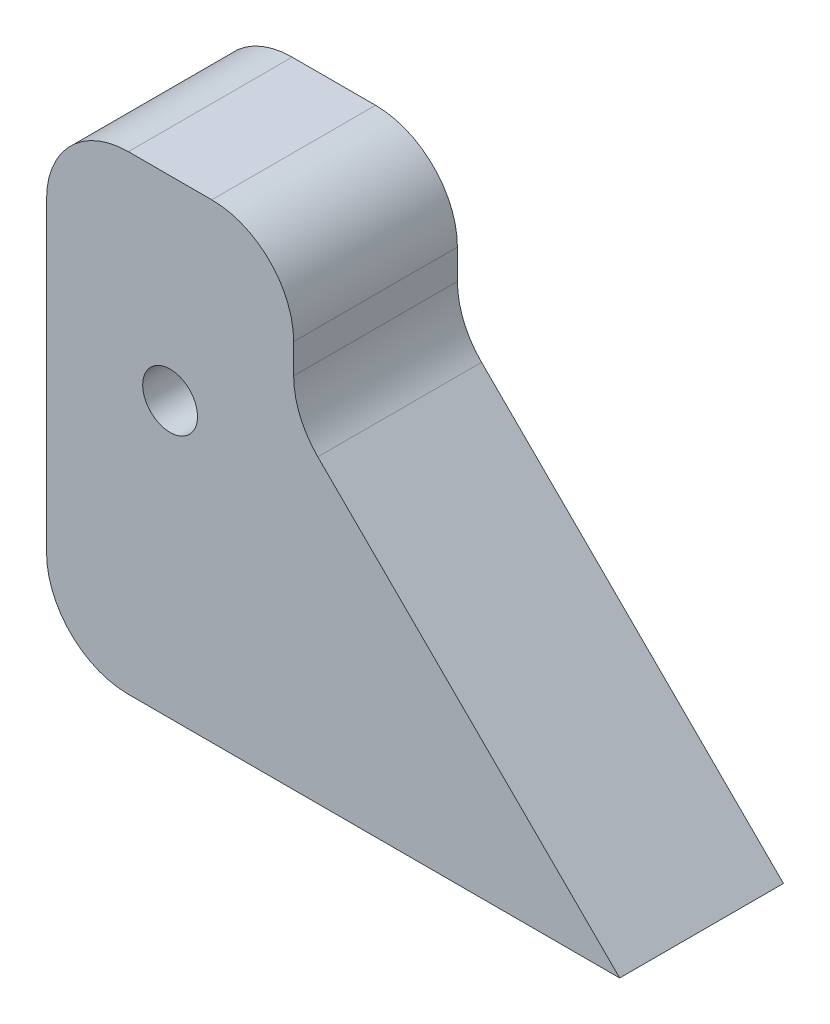
ISO-10303-21;
HEADER;
FILE_DESCRIPTION(('STEP AP214'),'2;1');
FILE_NAME('part.step','',(''),(''),'','','');
FILE_SCHEMA(('AUTOMOTIVE_DESIGN { 1 0 10303 214 1 1 1 1 }'));
ENDSEC;
DATA;
#1=APPLICATION_CONTEXT('core data for automotive mechanical design processes');
#2=APPLICATION_PROTOCOL_DEFINITION('international standard','automotive_design',2000,#1);
#3=PRODUCT_CONTEXT('',#1,'mechanical');
#4=PRODUCT('Part','Part','',(#3));
#5=PRODUCT_RELATED_PRODUCT_CATEGORY('part','',(#4));
#6=PRODUCT_DEFINITION_FORMATION('','',#4);
#7=PRODUCT_DEFINITION_CONTEXT('part definition',#1,'design');
#8=PRODUCT_DEFINITION('design','',#6,#7);
#9=PRODUCT_DEFINITION_SHAPE('','',#8);
#10=(LENGTH_UNIT() NAMED_UNIT(*) SI_UNIT(.MILLI.,.METRE.));
#11=(NAMED_UNIT(*) PLANE_ANGLE_UNIT() SI_UNIT($,.RADIAN.));
#12=(NAMED_UNIT(*) SI_UNIT($,.STERADIAN.) SOLID_ANGLE_UNIT());
#13=UNCERTAINTY_MEASURE_WITH_UNIT(LENGTH_MEASURE(1.E-05),#10,'distance_accuracy_value','');
#14=(GEOMETRIC_REPRESENTATION_CONTEXT(3) GLOBAL_UNCERTAINTY_ASSIGNED_CONTEXT((#13)) GLOBAL_UNIT_ASSIGNED_CONTEXT((#10,
#11,#12)) REPRESENTATION_CONTEXT('',''));
#15=CARTESIAN_POINT('',(0.,0.,0.));
#16=DIRECTION('',(0.,0.,1.));
#17=DIRECTION('',(1.,0.,0.));
#18=AXIS2_PLACEMENT_3D('',#15,#16,#17);
#19=CARTESIAN_POINT('',(0.,0.,10.));
#20=DIRECTION('',(1.,0.,0.));
#21=DIRECTION('',(0.,0.,-1.));
#22=AXIS2_PLACEMENT_3D('',#19,#20,#21);
#23=PLANE('',#22);
#24=DIRECTION('',(0.,-1.,0.));
#25=VECTOR('',#24,1.);
#26=CARTESIAN_POINT('',(0.,0.,0.));
#27=LINE('',#26,#25);
#28=CARTESIAN_POINT('',(0.,23.7,0.));
#29=VERTEX_POINT('',#28);
#30=CARTESIAN_POINT('',(0.,5.,0.));
#31=VERTEX_POINT('',#30);
#32=EDGE_CURVE('E149',#29,#31,#27,.T.);
#33=ORIENTED_EDGE('',*,*,#32,.T.);
#34=DIRECTION('',(0.,0.,-1.));
#35=VECTOR('',#34,1.);
#36=CARTESIAN_POINT('',(0.,5.,10.));
#37=LINE('',#36,#35);
#38=CARTESIAN_POINT('',(0.,5.,10.));
#39=VERTEX_POINT('',#38);
#40=EDGE_CURVE('E171',#31,#39,#37,.F.);
#41=ORIENTED_EDGE('',*,*,#40,.T.);
#42=DIRECTION('',(0.,-1.,0.));
#43=VECTOR('',#42,1.);
#44=CARTESIAN_POINT('',(0.,0.,10.));
#45=LINE('',#44,#43);
#46=CARTESIAN_POINT('',(0.,23.7,10.));
#47=VERTEX_POINT('',#46);
#48=EDGE_CURVE('E127',#47,#39,#45,.T.);
#49=ORIENTED_EDGE('',*,*,#48,.F.);
#50=DIRECTION('',(0.,0.,-1.));
#51=VECTOR('',#50,1.);
#52=CARTESIAN_POINT('',(0.,23.7,10.));
#53=LINE('',#52,#51);
#54=EDGE_CURVE('E168',#47,#29,#53,.T.);
#55=ORIENTED_EDGE('',*,*,#54,.T.);
#56=EDGE_LOOP('',(#33,#41,#49,#55));
#57=FACE_BOUND('',#56,.T.);
#58=ADVANCED_FACE('F43',(#57),#23,.F.);
#59=CARTESIAN_POINT('',(0.,0.,10.));
#60=DIRECTION('',(0.,1.,0.));
#61=DIRECTION('',(0.,0.,1.));
#62=AXIS2_PLACEMENT_3D('',#59,#60,#61);
#63=PLANE('',#62);
#64=DIRECTION('',(1.,0.,0.));
#65=VECTOR('',#64,1.);
#66=CARTESIAN_POINT('',(0.,0.,10.));
#67=LINE('',#66,#65);
#68=CARTESIAN_POINT('',(5.,0.,10.));
#69=VERTEX_POINT('',#68);
#70=CARTESIAN_POINT('',(35.,0.,10.));
#71=VERTEX_POINT('',#70);
#72=EDGE_CURVE('E115',#69,#71,#67,.T.);
#73=ORIENTED_EDGE('',*,*,#72,.F.);
#74=DIRECTION('',(0.,0.,-1.));
#75=VECTOR('',#74,1.);
#76=CARTESIAN_POINT('',(5.,0.,10.));
#77=LINE('',#76,#75);
#78=CARTESIAN_POINT('',(5.,0.,0.));
#79=VERTEX_POINT('',#78);
#80=EDGE_CURVE('E137',#69,#79,#77,.T.);
#81=ORIENTED_EDGE('',*,*,#80,.T.);
#82=DIRECTION('',(1.,0.,0.));
#83=VECTOR('',#82,1.);
#84=CARTESIAN_POINT('',(0.,0.,0.));
#85=LINE('',#84,#83);
#86=CARTESIAN_POINT('',(35.,0.,0.));
#87=VERTEX_POINT('',#86);
#88=EDGE_CURVE('E133',#79,#87,#85,.T.);
#89=ORIENTED_EDGE('',*,*,#88,.T.);
#90=DIRECTION('',(0.,0.,-1.));
#91=VECTOR('',#90,1.);
#92=CARTESIAN_POINT('',(35.,0.,10.));
#93=LINE('',#92,#91);
#94=EDGE_CURVE('E130',#71,#87,#93,.T.);
#95=ORIENTED_EDGE('',*,*,#94,.F.);
#96=EDGE_LOOP('',(#73,#81,#89,#95));
#97=FACE_BOUND('',#96,.T.);
#98=ADVANCED_FACE('F131',(#97),#63,.F.);
#99=CARTESIAN_POINT('',(15.09,19.81,10.));
#100=DIRECTION('',(-0.705324317313764,-0.708884763135641,0.));
#101=DIRECTION('',(0.708884763135641,-0.705324317313764,0.));
#102=AXIS2_PLACEMENT_3D('',#99,#100,#101);
#103=PLANE('',#102);
#104=DIRECTION('',(-0.708884763135641,0.705324317313764,0.));
#105=VECTOR('',#104,1.);
#106=CARTESIAN_POINT('',(15.09,19.81,0.));
#107=LINE('',#106,#105);
#108=CARTESIAN_POINT('',(16.5633784134312,18.3440217795042,0.));
#109=VERTEX_POINT('',#108);
#110=EDGE_CURVE('E154',#87,#109,#107,.T.);
#111=ORIENTED_EDGE('',*,*,#110,.T.);
#112=DIRECTION('',(0.,0.,-1.));
#113=VECTOR('',#112,1.);
#114=CARTESIAN_POINT('',(16.5633784134312,18.3440217795042,10.));
#115=LINE('',#114,#113);
#116=CARTESIAN_POINT('',(16.5633784134312,18.3440217795042,10.));
#117=VERTEX_POINT('',#116);
#118=EDGE_CURVE('E142',#109,#117,#115,.F.);
#119=ORIENTED_EDGE('',*,*,#118,.T.);
#120=DIRECTION('',(-0.708884763135641,0.705324317313764,0.));
#121=VECTOR('',#120,1.);
#122=CARTESIAN_POINT('',(15.09,19.81,10.));
#123=LINE('',#122,#121);
#124=EDGE_CURVE('E120',#71,#117,#123,.T.);
#125=ORIENTED_EDGE('',*,*,#124,.F.);
#126=ORIENTED_EDGE('',*,*,#94,.T.);
#127=EDGE_LOOP('',(#111,#119,#125,#126));
#128=FACE_BOUND('',#127,.T.);
#129=ADVANCED_FACE('F140',(#128),#103,.F.);
#130=CARTESIAN_POINT('',(15.09,28.7,10.));
#131=DIRECTION('',(-1.,0.,0.));
#132=DIRECTION('',(0.,-1.,0.));
#133=AXIS2_PLACEMENT_3D('',#130,#131,#132);
#134=PLANE('',#133);
#135=DIRECTION('',(0.,1.,0.));
#136=VECTOR('',#135,1.);
#137=CARTESIAN_POINT('',(15.09,28.7,10.));
#138=LINE('',#137,#136);
#139=CARTESIAN_POINT('',(15.09,21.8884455951824,10.));
#140=VERTEX_POINT('',#139);
#141=CARTESIAN_POINT('',(15.09,23.7,10.));
#142=VERTEX_POINT('',#141);
#143=EDGE_CURVE('E143',#140,#142,#138,.T.);
#144=ORIENTED_EDGE('',*,*,#143,.F.);
#145=DIRECTION('',(0.,0.,-1.));
#146=VECTOR('',#145,1.);
#147=CARTESIAN_POINT('',(15.09,21.8884455951824,0.));
#148=LINE('',#147,#146);
#149=CARTESIAN_POINT('',(15.09,21.8884455951824,0.));
#150=VERTEX_POINT('',#149);
#151=EDGE_CURVE('E179',#140,#150,#148,.T.);
#152=ORIENTED_EDGE('',*,*,#151,.T.);
#153=DIRECTION('',(0.,1.,0.));
#154=VECTOR('',#153,1.);
#155=CARTESIAN_POINT('',(15.09,28.7,0.));
#156=LINE('',#155,#154);
#157=CARTESIAN_POINT('',(15.09,23.7,0.));
#158=VERTEX_POINT('',#157);
#159=EDGE_CURVE('E156',#150,#158,#156,.T.);
#160=ORIENTED_EDGE('',*,*,#159,.T.);
#161=DIRECTION('',(0.,0.,-1.));
#162=VECTOR('',#161,1.);
#163=CARTESIAN_POINT('',(15.09,23.7,10.));
#164=LINE('',#163,#162);
#165=EDGE_CURVE('E177',#158,#142,#164,.F.);
#166=ORIENTED_EDGE('',*,*,#165,.T.);
#167=EDGE_LOOP('',(#144,#152,#160,#166));
#168=FACE_BOUND('',#167,.T.);
#169=ADVANCED_FACE('F195',(#168),#134,.F.);
#170=CARTESIAN_POINT('',(0.,28.7,10.));
#171=DIRECTION('',(0.,-1.,0.));
#172=DIRECTION('',(0.,0.,-1.));
#173=AXIS2_PLACEMENT_3D('',#170,#171,#172);
#174=PLANE('',#173);
#175=DIRECTION('',(-1.,0.,0.));
#176=VECTOR('',#175,1.);
#177=CARTESIAN_POINT('',(0.,28.7,10.));
#178=LINE('',#177,#176);
#179=CARTESIAN_POINT('',(10.09,28.7,10.));
#180=VERTEX_POINT('',#179);
#181=CARTESIAN_POINT('',(5.,28.7,10.));
#182=VERTEX_POINT('',#181);
#183=EDGE_CURVE('E138',#180,#182,#178,.T.);
#184=ORIENTED_EDGE('',*,*,#183,.F.);
#185=DIRECTION('',(0.,0.,-1.));
#186=VECTOR('',#185,1.);
#187=CARTESIAN_POINT('',(10.09,28.7,10.));
#188=LINE('',#187,#186);
#189=CARTESIAN_POINT('',(10.09,28.7,0.));
#190=VERTEX_POINT('',#189);
#191=EDGE_CURVE('E184',#180,#190,#188,.T.);
#192=ORIENTED_EDGE('',*,*,#191,.T.);
#193=DIRECTION('',(-1.,0.,0.));
#194=VECTOR('',#193,1.);
#195=CARTESIAN_POINT('',(0.,28.7,0.));
#196=LINE('',#195,#194);
#197=CARTESIAN_POINT('',(5.,28.7,0.));
#198=VERTEX_POINT('',#197);
#199=EDGE_CURVE('E159',#190,#198,#196,.T.);
#200=ORIENTED_EDGE('',*,*,#199,.T.);
#201=DIRECTION('',(0.,0.,-1.));
#202=VECTOR('',#201,1.);
#203=CARTESIAN_POINT('',(5.,28.7,10.));
#204=LINE('',#203,#202);
#205=EDGE_CURVE('E59',#198,#182,#204,.F.);
#206=ORIENTED_EDGE('',*,*,#205,.T.);
#207=EDGE_LOOP('',(#184,#192,#200,#206));
#208=FACE_BOUND('',#207,.T.);
#209=ADVANCED_FACE('F201',(#208),#174,.F.);
#210=CARTESIAN_POINT('',(0.,0.,10.));
#211=DIRECTION('',(0.,0.,-1.));
#212=DIRECTION('',(-1.,0.,0.));
#213=AXIS2_PLACEMENT_3D('',#210,#211,#212);
#214=PLANE('',#213);
#215=CARTESIAN_POINT('',(7.545,16.8,10.));
#216=DIRECTION('',(0.,0.,-1.));
#217=DIRECTION('',(-1.,0.,0.));
#218=AXIS2_PLACEMENT_3D('',#215,#216,#217);
#219=CIRCLE('',#218,1.675);
#220=CARTESIAN_POINT('',(5.87,16.8,10.));
#221=VERTEX_POINT('',#220);
#222=EDGE_CURVE('E215',#221,#221,#219,.T.);
#223=ORIENTED_EDGE('',*,*,#222,.T.);
#224=EDGE_LOOP('',(#223));
#225=FACE_BOUND('',#224,.T.);
#226=ORIENTED_EDGE('',*,*,#48,.T.);
#227=CARTESIAN_POINT('',(5.,5.,10.));
#228=DIRECTION('',(0.,0.,-1.));
#229=DIRECTION('',(-1.,0.,0.));
#230=AXIS2_PLACEMENT_3D('',#227,#228,#229);
#231=CIRCLE('',#230,5.);
#232=EDGE_CURVE('E123',#39,#69,#231,.F.);
#233=ORIENTED_EDGE('',*,*,#232,.T.);
#234=ORIENTED_EDGE('',*,*,#72,.T.);
#235=ORIENTED_EDGE('',*,*,#124,.T.);
#236=CARTESIAN_POINT('',(20.09,21.8884455951824,10.));
#237=DIRECTION('',(0.,0.,-1.));
#238=DIRECTION('',(-1.,0.,0.));
#239=AXIS2_PLACEMENT_3D('',#236,#237,#238);
#240=CIRCLE('',#239,5.);
#241=EDGE_CURVE('E11',#117,#140,#240,.T.);
#242=ORIENTED_EDGE('',*,*,#241,.T.);
#243=ORIENTED_EDGE('',*,*,#143,.T.);
#244=CARTESIAN_POINT('',(10.09,23.7,10.));
#245=DIRECTION('',(0.,0.,-1.));
#246=DIRECTION('',(-1.,0.,0.));
#247=AXIS2_PLACEMENT_3D('',#244,#245,#246);
#248=CIRCLE('',#247,5.);
#249=EDGE_CURVE('E66',#142,#180,#248,.F.);
#250=ORIENTED_EDGE('',*,*,#249,.T.);
#251=ORIENTED_EDGE('',*,*,#183,.T.);
#252=CARTESIAN_POINT('',(5.,23.7,10.));
#253=DIRECTION('',(0.,0.,-1.));
#254=DIRECTION('',(-1.,0.,0.));
#255=AXIS2_PLACEMENT_3D('',#252,#253,#254);
#256=CIRCLE('',#255,5.);
#257=EDGE_CURVE('E173',#182,#47,#256,.F.);
#258=ORIENTED_EDGE('',*,*,#257,.T.);
#259=EDGE_LOOP('',(#226,#233,#234,#235,#242,#243,#250,#251,#258));
#260=FACE_BOUND('',#259,.T.);
#261=ADVANCED_FACE('F118',(#225,#260),#214,.F.);
#262=CARTESIAN_POINT('',(0.,0.,0.));
#263=DIRECTION('',(0.,0.,-1.));
#264=DIRECTION('',(-1.,0.,0.));
#265=AXIS2_PLACEMENT_3D('',#262,#263,#264);
#266=PLANE('',#265);
#267=CARTESIAN_POINT('',(7.545,16.8,0.));
#268=DIRECTION('',(0.,0.,-1.));
#269=DIRECTION('',(-1.,0.,0.));
#270=AXIS2_PLACEMENT_3D('',#267,#268,#269);
#271=CIRCLE('',#270,3.2);
#272=CARTESIAN_POINT('',(4.345,16.8,0.));
#273=VERTEX_POINT('',#272);
#274=EDGE_CURVE('E210',#273,#273,#271,.T.);
#275=ORIENTED_EDGE('',*,*,#274,.F.);
#276=EDGE_LOOP('',(#275));
#277=FACE_BOUND('',#276,.T.);
#278=ORIENTED_EDGE('',*,*,#88,.F.);
#279=CARTESIAN_POINT('',(5.,5.,0.));
#280=DIRECTION('',(0.,0.,-1.));
#281=DIRECTION('',(-1.,0.,0.));
#282=AXIS2_PLACEMENT_3D('',#279,#280,#281);
#283=CIRCLE('',#282,5.);
#284=EDGE_CURVE('E166',#79,#31,#283,.T.);
#285=ORIENTED_EDGE('',*,*,#284,.T.);
#286=ORIENTED_EDGE('',*,*,#32,.F.);
#287=CARTESIAN_POINT('',(5.,23.7,0.));
#288=DIRECTION('',(0.,0.,-1.));
#289=DIRECTION('',(-1.,0.,0.));
#290=AXIS2_PLACEMENT_3D('',#287,#288,#289);
#291=CIRCLE('',#290,5.);
#292=EDGE_CURVE('E162',#29,#198,#291,.T.);
#293=ORIENTED_EDGE('',*,*,#292,.T.);
#294=ORIENTED_EDGE('',*,*,#199,.F.);
#295=CARTESIAN_POINT('',(10.09,23.7,0.));
#296=DIRECTION('',(0.,0.,-1.));
#297=DIRECTION('',(-1.,0.,0.));
#298=AXIS2_PLACEMENT_3D('',#295,#296,#297);
#299=CIRCLE('',#298,5.);
#300=EDGE_CURVE('E164',#190,#158,#299,.T.);
#301=ORIENTED_EDGE('',*,*,#300,.T.);
#302=ORIENTED_EDGE('',*,*,#159,.F.);
#303=CARTESIAN_POINT('',(20.09,21.8884455951824,0.));
#304=DIRECTION('',(0.,0.,-1.));
#305=DIRECTION('',(-1.,0.,0.));
#306=AXIS2_PLACEMENT_3D('',#303,#304,#305);
#307=CIRCLE('',#306,5.);
#308=EDGE_CURVE('E52',#150,#109,#307,.F.);
#309=ORIENTED_EDGE('',*,*,#308,.T.);
#310=ORIENTED_EDGE('',*,*,#110,.F.);
#311=EDGE_LOOP('',(#278,#285,#286,#293,#294,#301,#302,#309,#310));
#312=FACE_BOUND('',#311,.T.);
#313=ADVANCED_FACE('F189',(#277,#312),#266,.T.);
#314=CARTESIAN_POINT('',(5.,5.,10.));
#315=DIRECTION('',(0.,0.,-1.));
#316=DIRECTION('',(-1.,0.,0.));
#317=AXIS2_PLACEMENT_3D('',#314,#315,#316);
#318=CYLINDRICAL_SURFACE('',#317,5.);
#319=ORIENTED_EDGE('',*,*,#232,.F.);
#320=ORIENTED_EDGE('',*,*,#40,.F.);
#321=ORIENTED_EDGE('',*,*,#284,.F.);
#322=ORIENTED_EDGE('',*,*,#80,.F.);
#323=EDGE_LOOP('',(#319,#320,#321,#322));
#324=FACE_BOUND('',#323,.T.);
#325=ADVANCED_FACE('F238',(#324),#318,.T.);
#326=CARTESIAN_POINT('',(20.09,21.8884455951824,10.));
#327=DIRECTION('',(0.,0.,1.));
#328=DIRECTION('',(1.,0.,0.));
#329=AXIS2_PLACEMENT_3D('',#326,#327,#328);
#330=CYLINDRICAL_SURFACE('',#329,5.);
#331=ORIENTED_EDGE('',*,*,#241,.F.);
#332=ORIENTED_EDGE('',*,*,#118,.F.);
#333=ORIENTED_EDGE('',*,*,#308,.F.);
#334=ORIENTED_EDGE('',*,*,#151,.F.);
#335=EDGE_LOOP('',(#331,#332,#333,#334));
#336=FACE_BOUND('',#335,.T.);
#337=ADVANCED_FACE('F192',(#336),#330,.F.);
#338=CARTESIAN_POINT('',(10.09,23.7,10.));
#339=DIRECTION('',(0.,0.,-1.));
#340=DIRECTION('',(-1.,0.,0.));
#341=AXIS2_PLACEMENT_3D('',#338,#339,#340);
#342=CYLINDRICAL_SURFACE('',#341,5.);
#343=ORIENTED_EDGE('',*,*,#249,.F.);
#344=ORIENTED_EDGE('',*,*,#165,.F.);
#345=ORIENTED_EDGE('',*,*,#300,.F.);
#346=ORIENTED_EDGE('',*,*,#191,.F.);
#347=EDGE_LOOP('',(#343,#344,#345,#346));
#348=FACE_BOUND('',#347,.T.);
#349=ADVANCED_FACE('F198',(#348),#342,.T.);
#350=CARTESIAN_POINT('',(5.,23.7,10.));
#351=DIRECTION('',(0.,0.,-1.));
#352=DIRECTION('',(-1.,0.,0.));
#353=AXIS2_PLACEMENT_3D('',#350,#351,#352);
#354=CYLINDRICAL_SURFACE('',#353,5.);
#355=ORIENTED_EDGE('',*,*,#257,.F.);
#356=ORIENTED_EDGE('',*,*,#205,.F.);
#357=ORIENTED_EDGE('',*,*,#292,.F.);
#358=ORIENTED_EDGE('',*,*,#54,.F.);
#359=EDGE_LOOP('',(#355,#356,#357,#358));
#360=FACE_BOUND('',#359,.T.);
#361=ADVANCED_FACE('F45',(#360),#354,.T.);
#362=CARTESIAN_POINT('',(7.545,16.8,4.7));
#363=DIRECTION('',(0.,0.,-1.));
#364=DIRECTION('',(-1.,0.,0.));
#365=AXIS2_PLACEMENT_3D('',#362,#363,#364);
#366=PLANE('',#365);
#367=CARTESIAN_POINT('',(7.545,16.8,4.7));
#368=DIRECTION('',(0.,0.,-1.));
#369=DIRECTION('',(-1.,0.,0.));
#370=AXIS2_PLACEMENT_3D('',#367,#368,#369);
#371=CIRCLE('',#370,1.675);
#372=CARTESIAN_POINT('',(5.87,16.8,4.7));
#373=VERTEX_POINT('',#372);
#374=EDGE_CURVE('E47',#373,#373,#371,.T.);
#375=ORIENTED_EDGE('',*,*,#374,.F.);
#376=EDGE_LOOP('',(#375));
#377=FACE_BOUND('',#376,.T.);
#378=CARTESIAN_POINT('',(7.545,16.8,4.7));
#379=DIRECTION('',(0.,0.,-1.));
#380=DIRECTION('',(-1.,0.,0.));
#381=AXIS2_PLACEMENT_3D('',#378,#379,#380);
#382=CIRCLE('',#381,3.2);
#383=CARTESIAN_POINT('',(4.345,16.8,4.7));
#384=VERTEX_POINT('',#383);
#385=EDGE_CURVE('E152',#384,#384,#382,.T.);
#386=ORIENTED_EDGE('',*,*,#385,.T.);
#387=EDGE_LOOP('',(#386));
#388=FACE_BOUND('',#387,.T.);
#389=ADVANCED_FACE('F225',(#377,#388),#366,.T.);
#390=CARTESIAN_POINT('',(7.545,16.8,4.7));
#391=DIRECTION('',(0.,0.,-1.));
#392=DIRECTION('',(-1.,0.,0.));
#393=AXIS2_PLACEMENT_3D('',#390,#391,#392);
#394=CYLINDRICAL_SURFACE('',#393,3.2);
#395=ORIENTED_EDGE('',*,*,#385,.F.);
#396=EDGE_LOOP('',(#395));
#397=FACE_BOUND('',#396,.T.);
#398=ORIENTED_EDGE('',*,*,#274,.T.);
#399=EDGE_LOOP('',(#398));
#400=FACE_BOUND('',#399,.T.);
#401=ADVANCED_FACE('F228',(#397,#400),#394,.F.);
#402=CARTESIAN_POINT('',(7.545,16.8,10.));
#403=DIRECTION('',(0.,0.,-1.));
#404=DIRECTION('',(-1.,0.,0.));
#405=AXIS2_PLACEMENT_3D('',#402,#403,#404);
#406=CYLINDRICAL_SURFACE('',#405,1.675);
#407=ORIENTED_EDGE('',*,*,#374,.T.);
#408=EDGE_LOOP('',(#407));
#409=FACE_BOUND('',#408,.T.);
#410=ORIENTED_EDGE('',*,*,#222,.F.);
#411=EDGE_LOOP('',(#410));
#412=FACE_BOUND('',#411,.T.);
#413=ADVANCED_FACE('F222',(#409,#412),#406,.F.);
#414=CLOSED_SHELL('',(#58,#98,#129,#169,#209,#261,#313,#325,#337,#349,#361,#389,#401,#413));
#415=MANIFOLD_SOLID_BREP('B2',#414);
#416=ADVANCED_BREP_SHAPE_REPRESENTATION('',(#18,#415),#14);
#417=SHAPE_DEFINITION_REPRESENTATION(#9,#416);
ENDSEC;
END-ISO-10303-21;
